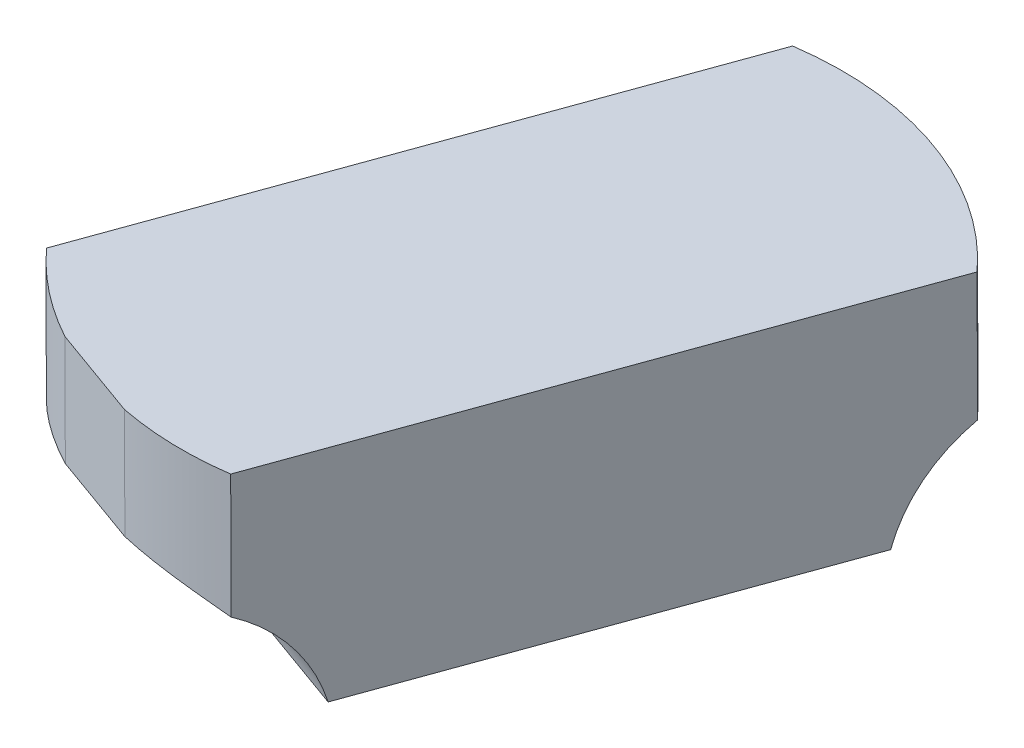
ISO-10303-21;
HEADER;
FILE_DESCRIPTION(('STEP AP214'),'2;1');
FILE_NAME('part.step','',(''),(''),'','','');
FILE_SCHEMA(('AUTOMOTIVE_DESIGN { 1 0 10303 214 1 1 1 1 }'));
ENDSEC;
DATA;
#1=APPLICATION_CONTEXT('core data for automotive mechanical design processes');
#2=APPLICATION_PROTOCOL_DEFINITION('international standard','automotive_design',2000,#1);
#3=PRODUCT_CONTEXT('',#1,'mechanical');
#4=PRODUCT('Part','Part','',(#3));
#5=PRODUCT_RELATED_PRODUCT_CATEGORY('part','',(#4));
#6=PRODUCT_DEFINITION_FORMATION('','',#4);
#7=PRODUCT_DEFINITION_CONTEXT('part definition',#1,'design');
#8=PRODUCT_DEFINITION('design','',#6,#7);
#9=PRODUCT_DEFINITION_SHAPE('','',#8);
#10=(LENGTH_UNIT() NAMED_UNIT(*) SI_UNIT(.MILLI.,.METRE.));
#11=(NAMED_UNIT(*) PLANE_ANGLE_UNIT() SI_UNIT($,.RADIAN.));
#12=(NAMED_UNIT(*) SI_UNIT($,.STERADIAN.) SOLID_ANGLE_UNIT());
#13=UNCERTAINTY_MEASURE_WITH_UNIT(LENGTH_MEASURE(1.E-05),#10,'distance_accuracy_value','');
#14=(GEOMETRIC_REPRESENTATION_CONTEXT(3) GLOBAL_UNCERTAINTY_ASSIGNED_CONTEXT((#13)) GLOBAL_UNIT_ASSIGNED_CONTEXT((#10,
#11,#12)) REPRESENTATION_CONTEXT('',''));
#15=CARTESIAN_POINT('',(0.,0.,0.));
#16=DIRECTION('',(0.,0.,1.));
#17=DIRECTION('',(1.,0.,0.));
#18=AXIS2_PLACEMENT_3D('',#15,#16,#17);
#19=CARTESIAN_POINT('',(226.50148278042,103.42678471457,-195.338206140158));
#20=DIRECTION('',(-0.00390183462676693,0.999992125769004,-0.000723938211519815));
#21=DIRECTION('',(0.340654989152249,0.000648546411320456,-0.940188150187628));
#22=AXIS2_PLACEMENT_3D('',#19,#20,#21);
#23=PLANE('',#22);
#24=DIRECTION('',(0.940180277421394,0.00391507184373613,0.340654837277103));
#25=VECTOR('',#24,1.);
#26=CARTESIAN_POINT('',(224.321052299101,103.43156501675,-176.983126282189));
#27=LINE('',#26,#25);
#28=CARTESIAN_POINT('',(223.04535757231,103.426252805243,-177.445347826481));
#29=VERTEX_POINT('',#28);
#30=CARTESIAN_POINT('',(225.596747026892,103.436877228241,-176.520904737899));
#31=VERTEX_POINT('',#30);
#32=EDGE_CURVE('E11',#29,#31,#27,.T.);
#33=ORIENTED_EDGE('',*,*,#32,.T.);
#34=CARTESIAN_POINT('',(227.35190409197,103.437335218652,-185.348102638608));
#35=DIRECTION('',(-0.00390183462676693,0.999992125769004,-0.000723938211519815));
#36=DIRECTION('',(-0.999991428626323,-0.00390082715659852,0.00138788377780223));
#37=AXIS2_PLACEMENT_3D('',#34,#35,#36);
#38=CIRCLE('',#37,8.9999999619);
#39=CARTESIAN_POINT('',(228.585982350483,103.448604373491,-176.433119566665));
#40=VERTEX_POINT('',#39);
#41=EDGE_CURVE('E33',#31,#40,#38,.T.);
#42=ORIENTED_EDGE('',*,*,#41,.T.);
#43=DIRECTION('',(-0.340654989152249,-0.000648546411340679,0.940188150187628));
#44=VECTOR('',#43,1.);
#45=CARTESIAN_POINT('',(231.298059101737,103.453767684474,-183.918295198021));
#46=LINE('',#45,#44);
#47=CARTESIAN_POINT('',(234.010135852989,103.458930995463,-191.403470830376));
#48=VERTEX_POINT('',#47);
#49=EDGE_CURVE('E96',#48,#40,#46,.T.);
#50=ORIENTED_EDGE('',*,*,#49,.F.);
#51=CARTESIAN_POINT('',(227.351904091925,103.437335218613,-185.348102670608));
#52=DIRECTION('',(-0.00390183462676693,0.999992125769004,-0.000723938211519815));
#53=DIRECTION('',(-0.999991428626323,-0.00390082715659852,0.00138788377780171));
#54=AXIS2_PLACEMENT_3D('',#51,#52,#53);
#55=CIRCLE('',#54,9.00000000592);
#56=CARTESIAN_POINT('',(226.111626554919,103.426042497716,-194.262225409816));
#57=VERTEX_POINT('',#56);
#58=EDGE_CURVE('E94',#48,#57,#55,.T.);
#59=ORIENTED_EDGE('',*,*,#58,.T.);
#60=DIRECTION('',(-0.340654989152249,-0.000648546411340679,0.940188150187628));
#61=VECTOR('',#60,1.);
#62=CARTESIAN_POINT('',(223.400544770953,103.420881081063,-186.779795831808));
#63=LINE('',#62,#61);
#64=CARTESIAN_POINT('',(220.689462987985,103.415719664289,-179.297366252801));
#65=VERTEX_POINT('',#64);
#66=EDGE_CURVE('E180',#57,#65,#63,.T.);
#67=ORIENTED_EDGE('',*,*,#66,.T.);
#68=CARTESIAN_POINT('',(227.351904142839,103.437335218695,-185.348102739675));
#69=DIRECTION('',(-0.00390183462676693,0.999992125769004,-0.000723938211519815));
#70=DIRECTION('',(-0.999991428626323,-0.00390082715659852,0.00138788377779932));
#71=AXIS2_PLACEMENT_3D('',#68,#69,#70);
#72=CIRCLE('',#71,9.00000007869);
#73=EDGE_CURVE('E165',#65,#29,#72,.T.);
#74=ORIENTED_EDGE('',*,*,#73,.T.);
#75=EDGE_LOOP('',(#33,#42,#50,#59,#67,#74));
#76=FACE_BOUND('',#75,.T.);
#77=ADVANCED_FACE('F17',(#76),#23,.T.);
#78=CARTESIAN_POINT('',(220.369692975136,103.415110879116,-178.414819436385));
#79=DIRECTION('',(-0.340654989152249,-0.000648546411340679,0.940188150187628));
#80=DIRECTION('',(-0.00390183462677384,0.999992125769004,-0.000723938211500811));
#81=AXIS2_PLACEMENT_3D('',#78,#79,#80);
#82=PLANE('',#81);
#83=DIRECTION('',(0.940180277421394,0.00391507184373613,0.340654837277103));
#84=VECTOR('',#83,1.);
#85=CARTESIAN_POINT('',(224.332757803729,100.43158863943,-176.980954466832));
#86=LINE('',#85,#84);
#87=CARTESIAN_POINT('',(223.057063078253,100.426276427992,-177.443176010419));
#88=VERTEX_POINT('',#87);
#89=CARTESIAN_POINT('',(225.608452528361,100.436900850949,-176.518732923777));
#90=VERTEX_POINT('',#89);
#91=EDGE_CURVE('E162',#88,#90,#86,.T.);
#92=ORIENTED_EDGE('',*,*,#91,.T.);
#93=DIRECTION('',(-0.00390183462676693,0.999992125769004,-0.000723938211519815));
#94=VECTOR('',#93,1.);
#95=CARTESIAN_POINT('',(225.602599778205,101.9368890396,-176.519818830719));
#96=LINE('',#95,#94);
#97=EDGE_CURVE('E157',#90,#31,#96,.T.);
#98=ORIENTED_EDGE('',*,*,#97,.T.);
#99=ORIENTED_EDGE('',*,*,#32,.F.);
#100=DIRECTION('',(0.00390183462676693,-0.999992125769004,0.000723938211519815));
#101=VECTOR('',#100,1.);
#102=CARTESIAN_POINT('',(223.051210324624,101.92626461658,-177.444261918302));
#103=LINE('',#102,#101);
#104=EDGE_CURVE('E156',#29,#88,#103,.T.);
#105=ORIENTED_EDGE('',*,*,#104,.T.);
#106=EDGE_LOOP('',(#92,#98,#99,#105));
#107=FACE_BOUND('',#106,.T.);
#108=ADVANCED_FACE('F198',(#107),#82,.T.);
#109=CARTESIAN_POINT('',(227.486146288267,69.0327155916437,-185.323195662148));
#110=DIRECTION('',(-0.00390183462676693,0.999992125769004,-0.000723938211519815));
#111=DIRECTION('',(-0.999991587813048,-0.0039009147543635,0.00126774098998158));
#112=AXIS2_PLACEMENT_3D('',#109,#110,#111);
#113=CYLINDRICAL_SURFACE('',#112,9.);
#114=ORIENTED_EDGE('',*,*,#41,.F.);
#115=ORIENTED_EDGE('',*,*,#97,.F.);
#116=CARTESIAN_POINT('',(228.599158204574,100.071795399318,-176.430674946011));
#117=CARTESIAN_POINT('',(228.511981651976,100.093941855659,-176.418633374352));
#118=CARTESIAN_POINT('',(228.424292567132,100.114676210071,-176.407823858325));
#119=CARTESIAN_POINT('',(228.248084712159,100.153563666032,-176.388739712007));
#120=CARTESIAN_POINT('',(228.159566083644,100.171717199899,-176.380464656894));
#121=CARTESIAN_POINT('',(227.893144780213,100.222656371611,-176.359552064782));
#122=CARTESIAN_POINT('',(227.714248545882,100.251952274524,-176.35080927509));
#123=CARTESIAN_POINT('',(227.357509385791,100.302635686019,-176.344088676923));
#124=CARTESIAN_POINT('',(227.179682056496,100.324119150487,-176.345975203595));
#125=CARTESIAN_POINT('',(226.823854297172,100.361132264882,-176.36032980492));
#126=CARTESIAN_POINT('',(226.645853885732,100.376662495751,-176.372796846701));
#127=CARTESIAN_POINT('',(226.324548410101,100.400442775974,-176.404936726719));
#128=CARTESIAN_POINT('',(226.181115742211,100.409517006605,-176.422776445622));
#129=CARTESIAN_POINT('',(225.894386427313,100.425066944389,-176.465473059467));
#130=CARTESIAN_POINT('',(225.751094413716,100.431528815159,-176.490366160942));
#131=CARTESIAN_POINT('',(225.608452528367,100.436900851014,-176.518732923796));
#132=B_SPLINE_CURVE_WITH_KNOTS('',3,(#116,#117,#118,#119,#120,#121,#122,#123,#124,#125,#126,
#127,#128,#129,#130,#131),.UNSPECIFIED.,.F.,.F.,(4,2,2,2,2,2,2,4),(0.,0.2721962493723,
0.544346848681864,1.0882495971702,1.62522622257788,2.1621504342358,2.59643231964779,
3.03298516053026),.UNSPECIFIED.);
#133=CARTESIAN_POINT('',(228.599158204511,100.071795398787,-176.430674945935));
#134=VERTEX_POINT('',#133);
#135=EDGE_CURVE('E119',#134,#90,#132,.T.);
#136=ORIENTED_EDGE('',*,*,#135,.F.);
#137=DIRECTION('',(-0.00390183462676693,0.999992125769004,-0.000723938211519815));
#138=VECTOR('',#137,1.);
#139=CARTESIAN_POINT('',(228.720224543854,69.0439847477369,-176.408212551194));
#140=LINE('',#139,#138);
#141=EDGE_CURVE('E158',#134,#40,#140,.T.);
#142=ORIENTED_EDGE('',*,*,#141,.T.);
#143=EDGE_LOOP('',(#114,#115,#136,#142));
#144=FACE_BOUND('',#143,.T.);
#145=ADVANCED_FACE('F187',(#144),#113,.T.);
#146=CARTESIAN_POINT('',(227.916067844401,96.3350917288441,-174.502454719827));
#147=DIRECTION('',(-0.940180277421394,-0.00391507184373613,-0.340654837277103));
#148=DIRECTION('',(0.340654989152333,0.000648546411341031,-0.940188150187597));
#149=AXIS2_PLACEMENT_3D('',#146,#147,#148);
#150=PLANE('',#149);
#151=ORIENTED_EDGE('',*,*,#141,.F.);
#152=CARTESIAN_POINT('',(227.916067848548,96.33509173833,-174.502454730784));
#153=DIRECTION('',(-0.940180277421394,-0.00391507184373613,-0.340654837277103));
#154=DIRECTION('',(-0.340260237895466,0.0602565524829509,0.938398699056105));
#155=AXIS2_PLACEMENT_3D('',#152,#153,#154);
#156=CIRCLE('',#155,4.25999998524);
#157=CARTESIAN_POINT('',(229.312583280874,97.4499903664353,-178.369539624179));
#158=VERTEX_POINT('',#157);
#159=EDGE_CURVE('E168',#134,#158,#156,.T.);
#160=ORIENTED_EDGE('',*,*,#159,.T.);
#161=DIRECTION('',(0.340654989152249,0.000648546411340679,-0.940188150187628));
#162=VECTOR('',#161,1.);
#163=CARTESIAN_POINT('',(231.356513215304,97.4538816449612,-184.01066852477));
#164=LINE('',#163,#162);
#165=CARTESIAN_POINT('',(233.40044315073,97.4577729233752,-189.651797426361));
#166=VERTEX_POINT('',#165);
#167=EDGE_CURVE('E104',#158,#166,#164,.T.);
#168=ORIENTED_EDGE('',*,*,#167,.T.);
#169=CARTESIAN_POINT('',(234.8056381483,96.3482082332414,-193.517271957581));
#170=DIRECTION('',(-0.940180277421394,-0.00391507184373613,-0.340654837277103));
#171=DIRECTION('',(-0.340260237895467,0.0602565524829513,0.938398699056105));
#172=AXIS2_PLACEMENT_3D('',#169,#170,#171);
#173=CIRCLE('',#172,4.26000001597);
#174=CARTESIAN_POINT('',(234.023781516074,99.9617155790006,-191.400939043685));
#175=VERTEX_POINT('',#174);
#176=EDGE_CURVE('E100',#166,#175,#173,.T.);
#177=ORIENTED_EDGE('',*,*,#176,.T.);
#178=DIRECTION('',(0.00390183462676694,-0.999992125769004,0.000723938211529814));
#179=VECTOR('',#178,1.);
#180=CARTESIAN_POINT('',(234.016958684138,101.710323286924,-191.402204937629));
#181=LINE('',#180,#179);
#182=EDGE_CURVE('E89',#48,#175,#181,.T.);
#183=ORIENTED_EDGE('',*,*,#182,.F.);
#184=ORIENTED_EDGE('',*,*,#49,.T.);
#185=EDGE_LOOP('',(#151,#160,#168,#177,#183,#184));
#186=FACE_BOUND('',#185,.T.);
#187=ADVANCED_FACE('F102',(#186),#150,.F.);
#188=CARTESIAN_POINT('',(227.486146288267,69.0327155916437,-185.323195662148));
#189=DIRECTION('',(-0.00390183462676693,0.999992125769004,-0.000723938211519815));
#190=DIRECTION('',(-0.999991587813048,-0.0039009147543635,0.00126774098998158));
#191=AXIS2_PLACEMENT_3D('',#188,#189,#190);
#192=CYLINDRICAL_SURFACE('',#191,9.);
#193=DIRECTION('',(0.00390183462676693,-0.999992125769004,0.000723938211519815));
#194=VECTOR('',#193,1.);
#195=CARTESIAN_POINT('',(226.245868747265,69.02142287048,-194.237318394351));
#196=LINE('',#195,#194);
#197=CARTESIAN_POINT('',(226.125279328872,99.9270045292794,-194.25969230233));
#198=VERTEX_POINT('',#197);
#199=EDGE_CURVE('E149',#57,#198,#196,.T.);
#200=ORIENTED_EDGE('',*,*,#199,.F.);
#201=ORIENTED_EDGE('',*,*,#58,.F.);
#202=ORIENTED_EDGE('',*,*,#182,.T.);
#203=CARTESIAN_POINT('',(230.426881469767,100.413970752848,-193.808594266529));
#204=CARTESIAN_POINT('',(230.540255401187,100.414445014747,-193.767558948652));
#205=CARTESIAN_POINT('',(230.652805928721,100.414215205444,-193.724241569131));
#206=CARTESIAN_POINT('',(230.876071099233,100.412278836113,-193.633125134793));
#207=CARTESIAN_POINT('',(230.98678565665,100.410572207457,-193.585325871795));
#208=CARTESIAN_POINT('',(231.206291229446,100.405611003036,-193.485280904738));
#209=CARTESIAN_POINT('',(231.315080165621,100.402354848702,-193.433030710987));
#210=CARTESIAN_POINT('',(231.530412028646,100.394154797529,-193.324234238));
#211=CARTESIAN_POINT('',(231.636955007308,100.389210939668,-193.267688058008));
#212=CARTESIAN_POINT('',(231.947655224195,100.371875588335,-193.094703701712));
#213=CARTESIAN_POINT('',(232.148438192387,100.35686979679,-192.972379638042));
#214=CARTESIAN_POINT('',(232.539126945288,100.317811548826,-192.712930601983));
#215=CARTESIAN_POINT('',(232.729039826613,100.293765074131,-192.575815458718));
#216=CARTESIAN_POINT('',(233.012871512054,100.24747350142,-192.353694294353));
#217=CARTESIAN_POINT('',(233.111160079179,100.229384600665,-192.27335620923));
#218=CARTESIAN_POINT('',(233.303765735385,100.189136288979,-192.109062478639));
#219=CARTESIAN_POINT('',(233.398084019703,100.166978114017,-192.025107937515));
#220=CARTESIAN_POINT('',(233.583748676754,100.117645577583,-191.852771933834));
#221=CARTESIAN_POINT('',(233.675036153179,100.09040627422,-191.764345397623));
#222=CARTESIAN_POINT('',(233.852982735927,100.03039111732,-191.584635922334));
#223=CARTESIAN_POINT('',(233.939638604994,99.9976114562791,-191.493351054312));
#224=CARTESIAN_POINT('',(234.023781516076,99.9617155787527,-191.400939043831));
#225=B_SPLINE_CURVE_WITH_KNOTS('',3,(#203,#204,#205,#206,#207,#208,#209,#210,#211,#212,#213,
#214,#215,#216,#217,#218,#219,#220,#221,#222,#223,#224),.UNSPECIFIED.,.F.,.F.,(4,2,2,2,2,2,2,2,
2,2,4),(0.,0.361690615563856,0.72339803980687,1.08547474274225,1.44754308384024,
2.15341315764563,2.85881701563579,3.24334635945911,3.62775910200385,4.01747135771776,
4.40745253279507),.UNSPECIFIED.);
#226=CARTESIAN_POINT('',(230.426881469767,100.413970752848,-193.808594266529));
#227=VERTEX_POINT('',#226);
#228=EDGE_CURVE('E22',#227,#175,#225,.T.);
#229=ORIENTED_EDGE('',*,*,#228,.F.);
#230=CARTESIAN_POINT('',(226.125279328723,99.9270045296932,-194.259692302571));
#231=CARTESIAN_POINT('',(226.211838696821,99.9528493377825,-194.271770912364));
#232=CARTESIAN_POINT('',(226.299006316758,99.9771607539865,-194.282639050027));
#233=CARTESIAN_POINT('',(226.474334982923,100.022967478534,-194.301868654858));
#234=CARTESIAN_POINT('',(226.562495830697,100.044463338976,-194.310230613874));
#235=CARTESIAN_POINT('',(226.827964351698,100.105067294981,-194.331417489863));
#236=CARTESIAN_POINT('',(227.006474778458,100.14035490176,-194.340373919936));
#237=CARTESIAN_POINT('',(227.361832287617,100.201954817955,-194.347488254152));
#238=CARTESIAN_POINT('',(227.538649975008,100.228419641196,-194.345840885489));
#239=CARTESIAN_POINT('',(227.892782053022,100.274734390302,-194.332030778752));
#240=CARTESIAN_POINT('',(228.070096570636,100.29458243224,-194.319865049433));
#241=CARTESIAN_POINT('',(228.430604467462,100.329489646189,-194.284333424029));
#242=CARTESIAN_POINT('',(228.613778514944,100.344349642604,-194.260578341259));
#243=CARTESIAN_POINT('',(228.978614110184,100.369317503008,-194.201771301222));
#244=CARTESIAN_POINT('',(229.160275692236,100.379425475032,-194.166719600808));
#245=CARTESIAN_POINT('',(229.524782168803,100.395803324128,-194.084643154784));
#246=CARTESIAN_POINT('',(229.707581426205,100.401994777094,-194.037398920758));
#247=CARTESIAN_POINT('',(229.979302628607,100.408521534017,-193.957975175778));
#248=CARTESIAN_POINT('',(230.069464915961,100.410237054893,-193.93007381878));
#249=CARTESIAN_POINT('',(230.248877640239,100.412770957826,-193.871446103317));
#250=CARTESIAN_POINT('',(230.338128090163,100.41358935269,-193.840719785187));
#251=CARTESIAN_POINT('',(230.426881469767,100.413970752848,-193.808594266529));
#252=B_SPLINE_CURVE_WITH_KNOTS('',3,(#230,#231,#232,#233,#234,#235,#236,#237,#238,#239,#240,
#241,#242,#243,#244,#245,#246,#247,#248,#249,#250,#251),.UNSPECIFIED.,.F.,.F.,(4,2,2,2,2,2,2,2,
2,2,4),(0.,0.27336472189847,0.54667575967312,1.09261648079932,1.62856056425604,2.16465711140819,
2.7201438914179,3.27561804212901,3.84188950742787,4.12503479589212,4.40817604217722),.UNSPECIFIED.);
#253=EDGE_CURVE('E110',#198,#227,#252,.T.);
#254=ORIENTED_EDGE('',*,*,#253,.F.);
#255=EDGE_LOOP('',(#200,#201,#202,#229,#254));
#256=FACE_BOUND('',#255,.T.);
#257=ADVANCED_FACE('F92',(#256),#192,.T.);
#258=CARTESIAN_POINT('',(220.018553513615,96.3022051253334,-177.363955353614));
#259=DIRECTION('',(-0.940180277421394,-0.00391507184373613,-0.340654837277103));
#260=DIRECTION('',(0.340654989152333,0.000648546411341031,-0.940188150187597));
#261=AXIS2_PLACEMENT_3D('',#258,#259,#260);
#262=PLANE('',#261);
#263=CARTESIAN_POINT('',(220.01855351467,96.3022051286209,-177.363955354599));
#264=DIRECTION('',(-0.940180277421394,-0.00391507184373613,-0.340654837277103));
#265=DIRECTION('',(-0.340260237895467,0.0602565524829517,0.938398699056105));
#266=AXIS2_PLACEMENT_3D('',#263,#264,#265);
#267=CIRCLE('',#266,4.25999999644);
#268=CARTESIAN_POINT('',(220.702645096264,100.037307856447,-179.294920473525));
#269=VERTEX_POINT('',#268);
#270=CARTESIAN_POINT('',(221.415068950091,97.4171037630196,-181.231040256967));
#271=VERTEX_POINT('',#270);
#272=EDGE_CURVE('E150',#269,#271,#267,.T.);
#273=ORIENTED_EDGE('',*,*,#272,.F.);
#274=DIRECTION('',(-0.00390183462676693,0.999992125769004,-0.000723938211519815));
#275=VECTOR('',#274,1.);
#276=CARTESIAN_POINT('',(220.696054042383,101.7265137601,-179.296143363817));
#277=LINE('',#276,#275);
#278=EDGE_CURVE('E97',#269,#65,#277,.T.);
#279=ORIENTED_EDGE('',*,*,#278,.T.);
#280=ORIENTED_EDGE('',*,*,#66,.F.);
#281=ORIENTED_EDGE('',*,*,#199,.T.);
#282=CARTESIAN_POINT('',(226.908123811755,96.31532164254,-196.378772573297));
#283=DIRECTION('',(-0.940180277421394,-0.00391507184373613,-0.340654837277103));
#284=DIRECTION('',(-0.340260237895466,0.06025655248295,0.938398699056105));
#285=AXIS2_PLACEMENT_3D('',#282,#283,#284);
#286=CIRCLE('',#285,4.25999999433);
#287=CARTESIAN_POINT('',(225.502928819945,97.4248863198596,-192.513298059149));
#288=VERTEX_POINT('',#287);
#289=EDGE_CURVE('E111',#288,#198,#286,.T.);
#290=ORIENTED_EDGE('',*,*,#289,.F.);
#291=DIRECTION('',(0.340654989152249,0.000648546411340679,-0.940188150187628));
#292=VECTOR('',#291,1.);
#293=CARTESIAN_POINT('',(223.458998885517,97.4209950414336,-186.872169158559));
#294=LINE('',#293,#292);
#295=EDGE_CURVE('E172',#271,#288,#294,.T.);
#296=ORIENTED_EDGE('',*,*,#295,.F.);
#297=EDGE_LOOP('',(#273,#279,#280,#281,#290,#296));
#298=FACE_BOUND('',#297,.T.);
#299=ADVANCED_FACE('F131',(#298),#262,.T.);
#300=CARTESIAN_POINT('',(227.486146288267,69.0327155916437,-185.323195662148));
#301=DIRECTION('',(-0.00390183462676693,0.999992125769004,-0.000723938211519815));
#302=DIRECTION('',(-0.999991587813048,-0.0039009147543635,0.00126774098998158));
#303=AXIS2_PLACEMENT_3D('',#300,#301,#302);
#304=CYLINDRICAL_SURFACE('',#303,9.);
#305=ORIENTED_EDGE('',*,*,#73,.F.);
#306=ORIENTED_EDGE('',*,*,#278,.F.);
#307=CARTESIAN_POINT('',(223.057063078402,100.426276427981,-177.443176010692));
#308=CARTESIAN_POINT('',(222.945462309241,100.420601670048,-177.503996220113));
#309=CARTESIAN_POINT('',(222.835182581029,100.414090730654,-177.567172181734));
#310=CARTESIAN_POINT('',(222.617487064439,100.399083919483,-177.698080163206));
#311=CARTESIAN_POINT('',(222.510071535977,100.390587868241,-177.765812594593));
#312=CARTESIAN_POINT('',(222.299347922926,100.371390405425,-177.905005553567));
#313=CARTESIAN_POINT('',(222.196010596338,100.360710615022,-177.976424755826));
#314=CARTESIAN_POINT('',(221.992616721441,100.33671449254,-178.123378179628));
#315=CARTESIAN_POINT('',(221.892560178893,100.323398155833,-178.198912408395));
#316=CARTESIAN_POINT('',(221.695931374654,100.293682231696,-178.35389951967));
#317=CARTESIAN_POINT('',(221.59936054112,100.277281397206,-178.433353977507));
#318=CARTESIAN_POINT('',(221.410011084591,100.240896757908,-178.595865963407));
#319=CARTESIAN_POINT('',(221.317232094052,100.22091330138,-178.678923140644));
#320=CARTESIAN_POINT('',(221.134864468767,100.176592703962,-178.849116310245));
#321=CARTESIAN_POINT('',(221.045314416348,100.152216086332,-178.936283505228));
#322=CARTESIAN_POINT('',(220.870602745575,100.098583325704,-179.113535428068));
#323=CARTESIAN_POINT('',(220.785442926042,100.06932520307,-179.203621327579));
#324=CARTESIAN_POINT('',(220.702645095934,100.037307856687,-179.294920473247));
#325=B_SPLINE_CURVE_WITH_KNOTS('',3,(#307,#308,#309,#310,#311,#312,#313,#314,#315,#316,#317,
#318,#319,#320,#321,#322,#323,#324),.UNSPECIFIED.,.F.,.F.,(4,2,2,2,2,2,2,2,4),(0.,
0.381648808845056,0.763332134115366,1.14140503564891,1.51947860096942,1.89770535099973,
2.27589535214413,2.65767056924736,3.03960098868646),.UNSPECIFIED.);
#326=EDGE_CURVE('E142',#88,#269,#325,.T.);
#327=ORIENTED_EDGE('',*,*,#326,.F.);
#328=ORIENTED_EDGE('',*,*,#104,.F.);
#329=EDGE_LOOP('',(#305,#306,#327,#328));
#330=FACE_BOUND('',#329,.T.);
#331=ADVANCED_FACE('F135',(#330),#304,.T.);
#332=CARTESIAN_POINT('',(220.018553513615,96.3022051253334,-177.363955353614));
#333=DIRECTION('',(0.940180277421394,0.00391507184373613,0.340654837277103));
#334=DIRECTION('',(-0.340661202993397,0.00107342639342276,0.940185509636725));
#335=AXIS2_PLACEMENT_3D('',#332,#333,#334);
#336=CYLINDRICAL_SURFACE('',#335,4.26);
#337=ORIENTED_EDGE('',*,*,#91,.F.);
#338=ORIENTED_EDGE('',*,*,#326,.T.);
#339=ORIENTED_EDGE('',*,*,#272,.T.);
#340=DIRECTION('',(0.940180277421394,0.00391507184373613,0.340654837277103));
#341=VECTOR('',#340,1.);
#342=CARTESIAN_POINT('',(221.415068949102,97.4171037637415,-181.231040257962));
#343=LINE('',#342,#341);
#344=EDGE_CURVE('E155',#271,#158,#343,.T.);
#345=ORIENTED_EDGE('',*,*,#344,.T.);
#346=ORIENTED_EDGE('',*,*,#159,.F.);
#347=ORIENTED_EDGE('',*,*,#135,.T.);
#348=EDGE_LOOP('',(#337,#338,#339,#345,#346,#347));
#349=FACE_BOUND('',#348,.T.);
#350=ADVANCED_FACE('F139',(#349),#336,.F.);
#351=CARTESIAN_POINT('',(223.45899888553,97.4209950422385,-186.872169159555));
#352=DIRECTION('',(0.00390183462676693,-0.999992125769004,0.000723938211519815));
#353=DIRECTION('',(-0.340654989152249,-0.000648546411320456,0.940188150187628));
#354=AXIS2_PLACEMENT_3D('',#351,#352,#353);
#355=PLANE('',#354);
#356=ORIENTED_EDGE('',*,*,#167,.F.);
#357=ORIENTED_EDGE('',*,*,#344,.F.);
#358=ORIENTED_EDGE('',*,*,#295,.T.);
#359=DIRECTION('',(0.940180277421394,0.00391507184373613,0.340654837277103));
#360=VECTOR('',#359,1.);
#361=CARTESIAN_POINT('',(229.451685986351,97.4413296224528,-191.082547743252));
#362=LINE('',#361,#360);
#363=EDGE_CURVE('E112',#288,#166,#362,.T.);
#364=ORIENTED_EDGE('',*,*,#363,.T.);
#365=EDGE_LOOP('',(#356,#357,#358,#364));
#366=FACE_BOUND('',#365,.T.);
#367=ADVANCED_FACE('F194',(#366),#355,.T.);
#368=CARTESIAN_POINT('',(226.908123813701,96.3153216397317,-196.378772578313));
#369=DIRECTION('',(0.940180277421394,0.00391507184373613,0.340654837277103));
#370=DIRECTION('',(-0.340661202993397,0.00107342639342276,0.940185509636725));
#371=AXIS2_PLACEMENT_3D('',#368,#369,#370);
#372=CYLINDRICAL_SURFACE('',#371,4.26);
#373=ORIENTED_EDGE('',*,*,#289,.T.);
#374=ORIENTED_EDGE('',*,*,#253,.T.);
#375=ORIENTED_EDGE('',*,*,#228,.T.);
#376=ORIENTED_EDGE('',*,*,#176,.F.);
#377=ORIENTED_EDGE('',*,*,#363,.F.);
#378=EDGE_LOOP('',(#373,#374,#375,#376,#377));
#379=FACE_BOUND('',#378,.T.);
#380=ADVANCED_FACE('F19',(#379),#372,.F.);
#381=CLOSED_SHELL('',(#77,#108,#145,#187,#257,#299,#331,#350,#367,#380));
#382=MANIFOLD_SOLID_BREP('B1',#381);
#383=ADVANCED_BREP_SHAPE_REPRESENTATION('',(#18,#382),#14);
#384=SHAPE_DEFINITION_REPRESENTATION(#9,#383);
ENDSEC;
END-ISO-10303-21;
